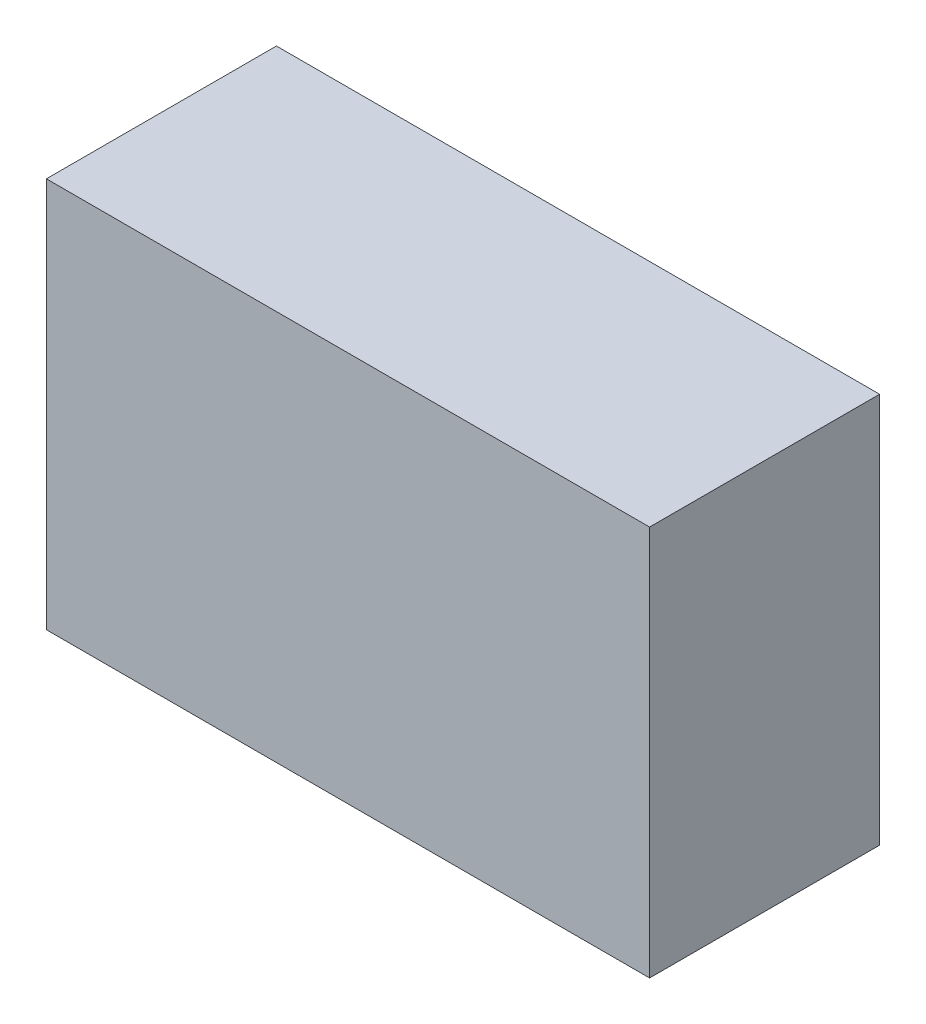
ISO-10303-21;
HEADER;
FILE_DESCRIPTION(('STEP AP214'),'2;1');
FILE_NAME('part.step','',(''),(''),'','','');
FILE_SCHEMA(('AUTOMOTIVE_DESIGN { 1 0 10303 214 1 1 1 1 }'));
ENDSEC;
DATA;
#1=APPLICATION_CONTEXT('core data for automotive mechanical design processes');
#2=APPLICATION_PROTOCOL_DEFINITION('international standard','automotive_design',2000,#1);
#3=PRODUCT_CONTEXT('',#1,'mechanical');
#4=PRODUCT('Part','Part','',(#3));
#5=PRODUCT_RELATED_PRODUCT_CATEGORY('part','',(#4));
#6=PRODUCT_DEFINITION_FORMATION('','',#4);
#7=PRODUCT_DEFINITION_CONTEXT('part definition',#1,'design');
#8=PRODUCT_DEFINITION('design','',#6,#7);
#9=PRODUCT_DEFINITION_SHAPE('','',#8);
#10=(LENGTH_UNIT() NAMED_UNIT(*) SI_UNIT(.MILLI.,.METRE.));
#11=(NAMED_UNIT(*) PLANE_ANGLE_UNIT() SI_UNIT($,.RADIAN.));
#12=(NAMED_UNIT(*) SI_UNIT($,.STERADIAN.) SOLID_ANGLE_UNIT());
#13=UNCERTAINTY_MEASURE_WITH_UNIT(LENGTH_MEASURE(1.E-05),#10,'distance_accuracy_value','');
#14=(GEOMETRIC_REPRESENTATION_CONTEXT(3) GLOBAL_UNCERTAINTY_ASSIGNED_CONTEXT((#13)) GLOBAL_UNIT_ASSIGNED_CONTEXT((#10,
#11,#12)) REPRESENTATION_CONTEXT('',''));
#15=CARTESIAN_POINT('',(0.,0.,0.));
#16=DIRECTION('',(0.,0.,1.));
#17=DIRECTION('',(1.,0.,0.));
#18=AXIS2_PLACEMENT_3D('',#15,#16,#17);
#19=CARTESIAN_POINT('',(43.1604630706538,-13.1268822356465,-45.));
#20=DIRECTION('',(1.,0.,0.));
#21=DIRECTION('',(0.,0.,-1.));
#22=AXIS2_PLACEMENT_3D('',#19,#20,#21);
#23=PLANE('',#22);
#24=DIRECTION('',(0.,1.,0.));
#25=VECTOR('',#24,1.);
#26=CARTESIAN_POINT('',(43.1604630706538,-13.1268822356465,0.));
#27=LINE('',#26,#25);
#28=CARTESIAN_POINT('',(43.1604630706538,-13.1268822356465,0.));
#29=VERTEX_POINT('',#28);
#30=CARTESIAN_POINT('',(43.1604630706538,63.2731177643535,0.));
#31=VERTEX_POINT('',#30);
#32=EDGE_CURVE('E97',#29,#31,#27,.T.);
#33=ORIENTED_EDGE('',*,*,#32,.F.);
#34=DIRECTION('',(0.,0.,1.));
#35=VECTOR('',#34,1.);
#36=CARTESIAN_POINT('',(43.1604630706538,-13.1268822356465,-45.));
#37=LINE('',#36,#35);
#38=CARTESIAN_POINT('',(43.1604630706538,-13.1268822356465,-45.));
#39=VERTEX_POINT('',#38);
#40=EDGE_CURVE('E11',#39,#29,#37,.T.);
#41=ORIENTED_EDGE('',*,*,#40,.F.);
#42=DIRECTION('',(0.,1.,0.));
#43=VECTOR('',#42,1.);
#44=CARTESIAN_POINT('',(43.1604630706538,-13.1268822356465,-45.));
#45=LINE('',#44,#43);
#46=CARTESIAN_POINT('',(43.1604630706538,63.2731177643535,-45.));
#47=VERTEX_POINT('',#46);
#48=EDGE_CURVE('E91',#39,#47,#45,.T.);
#49=ORIENTED_EDGE('',*,*,#48,.T.);
#50=DIRECTION('',(0.,0.,1.));
#51=VECTOR('',#50,1.);
#52=CARTESIAN_POINT('',(43.1604630706538,63.2731177643535,-45.));
#53=LINE('',#52,#51);
#54=EDGE_CURVE('E36',#47,#31,#53,.T.);
#55=ORIENTED_EDGE('',*,*,#54,.T.);
#56=EDGE_LOOP('',(#33,#41,#49,#55));
#57=FACE_BOUND('',#56,.T.);
#58=ADVANCED_FACE('F33',(#57),#23,.T.);
#59=CARTESIAN_POINT('',(-74.8395369293462,-13.1268822356465,-45.));
#60=DIRECTION('',(0.,-1.,0.));
#61=DIRECTION('',(0.,0.,-1.));
#62=AXIS2_PLACEMENT_3D('',#59,#60,#61);
#63=PLANE('',#62);
#64=DIRECTION('',(1.,0.,0.));
#65=VECTOR('',#64,1.);
#66=CARTESIAN_POINT('',(-74.8395369293462,-13.1268822356465,0.));
#67=LINE('',#66,#65);
#68=CARTESIAN_POINT('',(-74.8395369293462,-13.1268822356465,0.));
#69=VERTEX_POINT('',#68);
#70=EDGE_CURVE('E93',#69,#29,#67,.T.);
#71=ORIENTED_EDGE('',*,*,#70,.F.);
#72=DIRECTION('',(0.,0.,1.));
#73=VECTOR('',#72,1.);
#74=CARTESIAN_POINT('',(-74.8395369293462,-13.1268822356465,-45.));
#75=LINE('',#74,#73);
#76=CARTESIAN_POINT('',(-74.8395369293462,-13.1268822356465,-45.));
#77=VERTEX_POINT('',#76);
#78=EDGE_CURVE('E42',#77,#69,#75,.T.);
#79=ORIENTED_EDGE('',*,*,#78,.F.);
#80=DIRECTION('',(1.,0.,0.));
#81=VECTOR('',#80,1.);
#82=CARTESIAN_POINT('',(-74.8395369293462,-13.1268822356465,-45.));
#83=LINE('',#82,#81);
#84=EDGE_CURVE('E88',#77,#39,#83,.T.);
#85=ORIENTED_EDGE('',*,*,#84,.T.);
#86=ORIENTED_EDGE('',*,*,#40,.T.);
#87=EDGE_LOOP('',(#71,#79,#85,#86));
#88=FACE_BOUND('',#87,.T.);
#89=ADVANCED_FACE('F107',(#88),#63,.T.);
#90=CARTESIAN_POINT('',(-74.8395369293462,-13.1268822356465,-45.));
#91=DIRECTION('',(-1.,0.,0.));
#92=DIRECTION('',(0.,0.,1.));
#93=AXIS2_PLACEMENT_3D('',#90,#91,#92);
#94=PLANE('',#93);
#95=DIRECTION('',(0.,-1.,0.));
#96=VECTOR('',#95,1.);
#97=CARTESIAN_POINT('',(-74.8395369293462,-13.1268822356465,0.));
#98=LINE('',#97,#96);
#99=CARTESIAN_POINT('',(-74.8395369293462,63.2731177643535,0.));
#100=VERTEX_POINT('',#99);
#101=EDGE_CURVE('E83',#100,#69,#98,.T.);
#102=ORIENTED_EDGE('',*,*,#101,.F.);
#103=DIRECTION('',(0.,0.,1.));
#104=VECTOR('',#103,1.);
#105=CARTESIAN_POINT('',(-74.8395369293462,63.2731177643535,-45.));
#106=LINE('',#105,#104);
#107=CARTESIAN_POINT('',(-74.8395369293462,63.2731177643535,-45.));
#108=VERTEX_POINT('',#107);
#109=EDGE_CURVE('E78',#108,#100,#106,.T.);
#110=ORIENTED_EDGE('',*,*,#109,.F.);
#111=DIRECTION('',(0.,-1.,0.));
#112=VECTOR('',#111,1.);
#113=CARTESIAN_POINT('',(-74.8395369293462,-13.1268822356465,-45.));
#114=LINE('',#113,#112);
#115=EDGE_CURVE('E81',#108,#77,#114,.T.);
#116=ORIENTED_EDGE('',*,*,#115,.T.);
#117=ORIENTED_EDGE('',*,*,#78,.T.);
#118=EDGE_LOOP('',(#102,#110,#116,#117));
#119=FACE_BOUND('',#118,.T.);
#120=ADVANCED_FACE('F80',(#119),#94,.T.);
#121=CARTESIAN_POINT('',(-74.8395369293462,63.2731177643535,-45.));
#122=DIRECTION('',(0.,1.,0.));
#123=DIRECTION('',(0.,0.,1.));
#124=AXIS2_PLACEMENT_3D('',#121,#122,#123);
#125=PLANE('',#124);
#126=DIRECTION('',(-1.,0.,0.));
#127=VECTOR('',#126,1.);
#128=CARTESIAN_POINT('',(-74.8395369293462,63.2731177643535,0.));
#129=LINE('',#128,#127);
#130=EDGE_CURVE('E100',#31,#100,#129,.T.);
#131=ORIENTED_EDGE('',*,*,#130,.F.);
#132=ORIENTED_EDGE('',*,*,#54,.F.);
#133=DIRECTION('',(-1.,0.,0.));
#134=VECTOR('',#133,1.);
#135=CARTESIAN_POINT('',(-74.8395369293462,63.2731177643535,-45.));
#136=LINE('',#135,#134);
#137=EDGE_CURVE('E87',#47,#108,#136,.T.);
#138=ORIENTED_EDGE('',*,*,#137,.T.);
#139=ORIENTED_EDGE('',*,*,#109,.T.);
#140=EDGE_LOOP('',(#131,#132,#138,#139));
#141=FACE_BOUND('',#140,.T.);
#142=ADVANCED_FACE('F90',(#141),#125,.T.);
#143=CARTESIAN_POINT('',(0.,0.,-45.));
#144=DIRECTION('',(0.,0.,-1.));
#145=DIRECTION('',(-1.,0.,0.));
#146=AXIS2_PLACEMENT_3D('',#143,#144,#145);
#147=PLANE('',#146);
#148=ORIENTED_EDGE('',*,*,#48,.F.);
#149=ORIENTED_EDGE('',*,*,#84,.F.);
#150=ORIENTED_EDGE('',*,*,#115,.F.);
#151=ORIENTED_EDGE('',*,*,#137,.F.);
#152=EDGE_LOOP('',(#148,#149,#150,#151));
#153=FACE_BOUND('',#152,.T.);
#154=ADVANCED_FACE('F86',(#153),#147,.T.);
#155=CARTESIAN_POINT('',(0.,0.,0.));
#156=DIRECTION('',(0.,0.,-1.));
#157=DIRECTION('',(-1.,0.,0.));
#158=AXIS2_PLACEMENT_3D('',#155,#156,#157);
#159=PLANE('',#158);
#160=ORIENTED_EDGE('',*,*,#32,.T.);
#161=ORIENTED_EDGE('',*,*,#130,.T.);
#162=ORIENTED_EDGE('',*,*,#101,.T.);
#163=ORIENTED_EDGE('',*,*,#70,.T.);
#164=EDGE_LOOP('',(#160,#161,#162,#163));
#165=FACE_BOUND('',#164,.T.);
#166=ADVANCED_FACE('F106',(#165),#159,.F.);
#167=CLOSED_SHELL('',(#58,#89,#120,#142,#154,#166));
#168=MANIFOLD_SOLID_BREP('B2',#167);
#169=ADVANCED_BREP_SHAPE_REPRESENTATION('',(#18,#168),#14);
#170=SHAPE_DEFINITION_REPRESENTATION(#9,#169);
ENDSEC;
END-ISO-10303-21;
